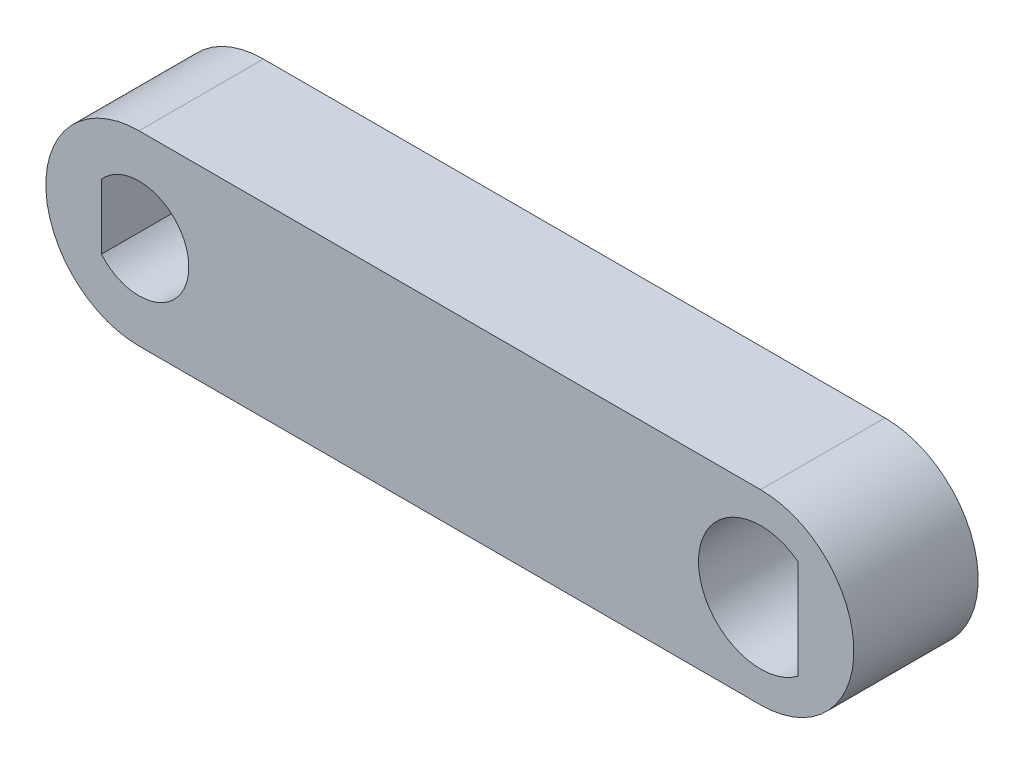
ISO-10303-21;
HEADER;
FILE_DESCRIPTION(('STEP AP214'),'2;1');
FILE_NAME('part.step','',(''),(''),'','','');
FILE_SCHEMA(('AUTOMOTIVE_DESIGN { 1 0 10303 214 1 1 1 1 }'));
ENDSEC;
DATA;
#1=APPLICATION_CONTEXT('core data for automotive mechanical design processes');
#2=APPLICATION_PROTOCOL_DEFINITION('international standard','automotive_design',2000,#1);
#3=PRODUCT_CONTEXT('',#1,'mechanical');
#4=PRODUCT('Part','Part','',(#3));
#5=PRODUCT_RELATED_PRODUCT_CATEGORY('part','',(#4));
#6=PRODUCT_DEFINITION_FORMATION('','',#4);
#7=PRODUCT_DEFINITION_CONTEXT('part definition',#1,'design');
#8=PRODUCT_DEFINITION('design','',#6,#7);
#9=PRODUCT_DEFINITION_SHAPE('','',#8);
#10=(LENGTH_UNIT() NAMED_UNIT(*) SI_UNIT(.MILLI.,.METRE.));
#11=(NAMED_UNIT(*) PLANE_ANGLE_UNIT() SI_UNIT($,.RADIAN.));
#12=(NAMED_UNIT(*) SI_UNIT($,.STERADIAN.) SOLID_ANGLE_UNIT());
#13=UNCERTAINTY_MEASURE_WITH_UNIT(LENGTH_MEASURE(1.E-05),#10,'distance_accuracy_value','');
#14=(GEOMETRIC_REPRESENTATION_CONTEXT(3) GLOBAL_UNCERTAINTY_ASSIGNED_CONTEXT((#13)) GLOBAL_UNIT_ASSIGNED_CONTEXT((#10,
#11,#12)) REPRESENTATION_CONTEXT('',''));
#15=CARTESIAN_POINT('',(0.,0.,0.));
#16=DIRECTION('',(0.,0.,1.));
#17=DIRECTION('',(1.,0.,0.));
#18=AXIS2_PLACEMENT_3D('',#15,#16,#17);
#19=CARTESIAN_POINT('',(0.,0.,10.));
#20=DIRECTION('',(0.,0.,1.));
#21=DIRECTION('',(1.,0.,0.));
#22=AXIS2_PLACEMENT_3D('',#19,#20,#21);
#23=PLANE('',#22);
#24=CARTESIAN_POINT('',(0.,0.,10.));
#25=DIRECTION('',(0.,0.,1.));
#26=DIRECTION('',(1.,0.,0.));
#27=AXIS2_PLACEMENT_3D('',#24,#25,#26);
#28=CIRCLE('',#27,7.5);
#29=CARTESIAN_POINT('',(0.,7.5,10.));
#30=VERTEX_POINT('',#29);
#31=CARTESIAN_POINT('',(0.,-7.5,10.));
#32=VERTEX_POINT('',#31);
#33=EDGE_CURVE('E130',#30,#32,#28,.T.);
#34=ORIENTED_EDGE('',*,*,#33,.T.);
#35=DIRECTION('',(1.,0.,0.));
#36=VECTOR('',#35,1.);
#37=CARTESIAN_POINT('',(0.,-7.5,10.));
#38=LINE('',#37,#36);
#39=CARTESIAN_POINT('',(50.,-7.5,10.));
#40=VERTEX_POINT('',#39);
#41=EDGE_CURVE('E133',#32,#40,#38,.T.);
#42=ORIENTED_EDGE('',*,*,#41,.T.);
#43=CARTESIAN_POINT('',(50.,0.,10.));
#44=DIRECTION('',(0.,0.,1.));
#45=DIRECTION('',(1.,0.,0.));
#46=AXIS2_PLACEMENT_3D('',#43,#44,#45);
#47=CIRCLE('',#46,7.5);
#48=CARTESIAN_POINT('',(50.,7.5,10.));
#49=VERTEX_POINT('',#48);
#50=EDGE_CURVE('E136',#40,#49,#47,.T.);
#51=ORIENTED_EDGE('',*,*,#50,.T.);
#52=DIRECTION('',(-1.,0.,0.));
#53=VECTOR('',#52,1.);
#54=CARTESIAN_POINT('',(0.,7.5,10.));
#55=LINE('',#54,#53);
#56=EDGE_CURVE('E138',#49,#30,#55,.T.);
#57=ORIENTED_EDGE('',*,*,#56,.T.);
#58=EDGE_LOOP('',(#34,#42,#51,#57));
#59=FACE_BOUND('',#58,.T.);
#60=DIRECTION('',(0.,1.,0.));
#61=VECTOR('',#60,1.);
#62=CARTESIAN_POINT('',(53.,4.,10.));
#63=LINE('',#62,#61);
#64=CARTESIAN_POINT('',(53.,-4.,10.));
#65=VERTEX_POINT('',#64);
#66=CARTESIAN_POINT('',(53.,4.,10.));
#67=VERTEX_POINT('',#66);
#68=EDGE_CURVE('E116',#65,#67,#63,.T.);
#69=ORIENTED_EDGE('',*,*,#68,.F.);
#70=CARTESIAN_POINT('',(50.,0.,10.));
#71=DIRECTION('',(0.,0.,1.));
#72=DIRECTION('',(1.,0.,0.));
#73=AXIS2_PLACEMENT_3D('',#70,#71,#72);
#74=CIRCLE('',#73,5.);
#75=EDGE_CURVE('E113',#67,#65,#74,.T.);
#76=ORIENTED_EDGE('',*,*,#75,.F.);
#77=EDGE_LOOP('',(#69,#76));
#78=FACE_BOUND('',#77,.T.);
#79=DIRECTION('',(0.,-1.,0.));
#80=VECTOR('',#79,1.);
#81=CARTESIAN_POINT('',(-3.02977091663549,2.61160643909256,10.));
#82=LINE('',#81,#80);
#83=CARTESIAN_POINT('',(-3.02977091663549,2.61160643909256,10.));
#84=VERTEX_POINT('',#83);
#85=CARTESIAN_POINT('',(-3.02977091663549,-2.61160643909256,10.));
#86=VERTEX_POINT('',#85);
#87=EDGE_CURVE('E96',#84,#86,#82,.T.);
#88=ORIENTED_EDGE('',*,*,#87,.F.);
#89=CARTESIAN_POINT('',(0.,0.,10.));
#90=DIRECTION('',(0.,0.,1.));
#91=DIRECTION('',(1.,0.,0.));
#92=AXIS2_PLACEMENT_3D('',#89,#90,#91);
#93=CIRCLE('',#92,4.);
#94=EDGE_CURVE('E102',#86,#84,#93,.T.);
#95=ORIENTED_EDGE('',*,*,#94,.F.);
#96=EDGE_LOOP('',(#88,#95));
#97=FACE_BOUND('',#96,.T.);
#98=ADVANCED_FACE('F32',(#59,#78,#97),#23,.T.);
#99=CARTESIAN_POINT('',(0.,0.,0.));
#100=DIRECTION('',(0.,0.,1.));
#101=DIRECTION('',(1.,0.,0.));
#102=AXIS2_PLACEMENT_3D('',#99,#100,#101);
#103=PLANE('',#102);
#104=CARTESIAN_POINT('',(50.,0.,0.));
#105=DIRECTION('',(0.,0.,1.));
#106=DIRECTION('',(1.,0.,0.));
#107=AXIS2_PLACEMENT_3D('',#104,#105,#106);
#108=CIRCLE('',#107,5.);
#109=CARTESIAN_POINT('',(53.,4.,0.));
#110=VERTEX_POINT('',#109);
#111=CARTESIAN_POINT('',(53.,-4.,0.));
#112=VERTEX_POINT('',#111);
#113=EDGE_CURVE('E112',#110,#112,#108,.T.);
#114=ORIENTED_EDGE('',*,*,#113,.T.);
#115=DIRECTION('',(0.,1.,0.));
#116=VECTOR('',#115,1.);
#117=CARTESIAN_POINT('',(53.,4.,0.));
#118=LINE('',#117,#116);
#119=EDGE_CURVE('E117',#112,#110,#118,.T.);
#120=ORIENTED_EDGE('',*,*,#119,.T.);
#121=EDGE_LOOP('',(#114,#120));
#122=FACE_BOUND('',#121,.T.);
#123=CARTESIAN_POINT('',(0.,0.,0.));
#124=DIRECTION('',(0.,0.,1.));
#125=DIRECTION('',(1.,0.,0.));
#126=AXIS2_PLACEMENT_3D('',#123,#124,#125);
#127=CIRCLE('',#126,7.5);
#128=CARTESIAN_POINT('',(0.,7.5,0.));
#129=VERTEX_POINT('',#128);
#130=CARTESIAN_POINT('',(0.,-7.5,0.));
#131=VERTEX_POINT('',#130);
#132=EDGE_CURVE('E129',#129,#131,#127,.T.);
#133=ORIENTED_EDGE('',*,*,#132,.F.);
#134=DIRECTION('',(-1.,0.,0.));
#135=VECTOR('',#134,1.);
#136=CARTESIAN_POINT('',(0.,7.5,0.));
#137=LINE('',#136,#135);
#138=CARTESIAN_POINT('',(50.,7.5,0.));
#139=VERTEX_POINT('',#138);
#140=EDGE_CURVE('E134',#139,#129,#137,.T.);
#141=ORIENTED_EDGE('',*,*,#140,.F.);
#142=CARTESIAN_POINT('',(50.,0.,0.));
#143=DIRECTION('',(0.,0.,1.));
#144=DIRECTION('',(1.,0.,0.));
#145=AXIS2_PLACEMENT_3D('',#142,#143,#144);
#146=CIRCLE('',#145,7.5);
#147=CARTESIAN_POINT('',(50.,-7.5,0.));
#148=VERTEX_POINT('',#147);
#149=EDGE_CURVE('E145',#148,#139,#146,.T.);
#150=ORIENTED_EDGE('',*,*,#149,.F.);
#151=DIRECTION('',(1.,0.,0.));
#152=VECTOR('',#151,1.);
#153=CARTESIAN_POINT('',(0.,-7.5,0.));
#154=LINE('',#153,#152);
#155=EDGE_CURVE('E143',#131,#148,#154,.T.);
#156=ORIENTED_EDGE('',*,*,#155,.F.);
#157=EDGE_LOOP('',(#133,#141,#150,#156));
#158=FACE_BOUND('',#157,.T.);
#159=CARTESIAN_POINT('',(0.,0.,0.));
#160=DIRECTION('',(0.,0.,1.));
#161=DIRECTION('',(1.,0.,0.));
#162=AXIS2_PLACEMENT_3D('',#159,#160,#161);
#163=CIRCLE('',#162,4.);
#164=CARTESIAN_POINT('',(-3.02977091663549,-2.61160643909256,0.));
#165=VERTEX_POINT('',#164);
#166=CARTESIAN_POINT('',(-3.02977091663549,2.61160643909256,0.));
#167=VERTEX_POINT('',#166);
#168=EDGE_CURVE('E54',#165,#167,#163,.T.);
#169=ORIENTED_EDGE('',*,*,#168,.T.);
#170=DIRECTION('',(0.,-1.,0.));
#171=VECTOR('',#170,1.);
#172=CARTESIAN_POINT('',(-3.02977091663549,2.61160643909256,0.));
#173=LINE('',#172,#171);
#174=EDGE_CURVE('E106',#167,#165,#173,.T.);
#175=ORIENTED_EDGE('',*,*,#174,.T.);
#176=EDGE_LOOP('',(#169,#175));
#177=FACE_BOUND('',#176,.T.);
#178=ADVANCED_FACE('F163',(#122,#158,#177),#103,.F.);
#179=CARTESIAN_POINT('',(0.,0.,10.));
#180=DIRECTION('',(0.,0.,-1.));
#181=DIRECTION('',(-1.,0.,0.));
#182=AXIS2_PLACEMENT_3D('',#179,#180,#181);
#183=CYLINDRICAL_SURFACE('',#182,7.5);
#184=ORIENTED_EDGE('',*,*,#132,.T.);
#185=DIRECTION('',(0.,0.,-1.));
#186=VECTOR('',#185,1.);
#187=CARTESIAN_POINT('',(0.,-7.5,10.));
#188=LINE('',#187,#186);
#189=EDGE_CURVE('E11',#32,#131,#188,.T.);
#190=ORIENTED_EDGE('',*,*,#189,.F.);
#191=ORIENTED_EDGE('',*,*,#33,.F.);
#192=DIRECTION('',(0.,0.,-1.));
#193=VECTOR('',#192,1.);
#194=CARTESIAN_POINT('',(0.,7.5,10.));
#195=LINE('',#194,#193);
#196=EDGE_CURVE('E140',#30,#129,#195,.T.);
#197=ORIENTED_EDGE('',*,*,#196,.T.);
#198=EDGE_LOOP('',(#184,#190,#191,#197));
#199=FACE_BOUND('',#198,.T.);
#200=ADVANCED_FACE('F34',(#199),#183,.T.);
#201=CARTESIAN_POINT('',(0.,-7.5,10.));
#202=DIRECTION('',(0.,1.,0.));
#203=DIRECTION('',(0.,0.,1.));
#204=AXIS2_PLACEMENT_3D('',#201,#202,#203);
#205=PLANE('',#204);
#206=ORIENTED_EDGE('',*,*,#155,.T.);
#207=DIRECTION('',(0.,0.,-1.));
#208=VECTOR('',#207,1.);
#209=CARTESIAN_POINT('',(50.,-7.5,10.));
#210=LINE('',#209,#208);
#211=EDGE_CURVE('E40',#40,#148,#210,.T.);
#212=ORIENTED_EDGE('',*,*,#211,.F.);
#213=ORIENTED_EDGE('',*,*,#41,.F.);
#214=ORIENTED_EDGE('',*,*,#189,.T.);
#215=EDGE_LOOP('',(#206,#212,#213,#214));
#216=FACE_BOUND('',#215,.T.);
#217=ADVANCED_FACE('F174',(#216),#205,.F.);
#218=CARTESIAN_POINT('',(50.,0.,10.));
#219=DIRECTION('',(0.,0.,-1.));
#220=DIRECTION('',(-1.,0.,0.));
#221=AXIS2_PLACEMENT_3D('',#218,#219,#220);
#222=CYLINDRICAL_SURFACE('',#221,7.5);
#223=ORIENTED_EDGE('',*,*,#149,.T.);
#224=DIRECTION('',(0.,0.,-1.));
#225=VECTOR('',#224,1.);
#226=CARTESIAN_POINT('',(50.,7.5,10.));
#227=LINE('',#226,#225);
#228=EDGE_CURVE('E150',#49,#139,#227,.T.);
#229=ORIENTED_EDGE('',*,*,#228,.F.);
#230=ORIENTED_EDGE('',*,*,#50,.F.);
#231=ORIENTED_EDGE('',*,*,#211,.T.);
#232=EDGE_LOOP('',(#223,#229,#230,#231));
#233=FACE_BOUND('',#232,.T.);
#234=ADVANCED_FACE('F157',(#233),#222,.T.);
#235=CARTESIAN_POINT('',(0.,7.5,10.));
#236=DIRECTION('',(0.,-1.,0.));
#237=DIRECTION('',(0.,0.,-1.));
#238=AXIS2_PLACEMENT_3D('',#235,#236,#237);
#239=PLANE('',#238);
#240=ORIENTED_EDGE('',*,*,#140,.T.);
#241=ORIENTED_EDGE('',*,*,#196,.F.);
#242=ORIENTED_EDGE('',*,*,#56,.F.);
#243=ORIENTED_EDGE('',*,*,#228,.T.);
#244=EDGE_LOOP('',(#240,#241,#242,#243));
#245=FACE_BOUND('',#244,.T.);
#246=ADVANCED_FACE('F167',(#245),#239,.F.);
#247=CARTESIAN_POINT('',(50.,0.,10.));
#248=DIRECTION('',(0.,0.,-1.));
#249=DIRECTION('',(-1.,0.,0.));
#250=AXIS2_PLACEMENT_3D('',#247,#248,#249);
#251=CYLINDRICAL_SURFACE('',#250,5.);
#252=ORIENTED_EDGE('',*,*,#113,.F.);
#253=DIRECTION('',(0.,0.,-1.));
#254=VECTOR('',#253,1.);
#255=CARTESIAN_POINT('',(53.,4.,10.));
#256=LINE('',#255,#254);
#257=EDGE_CURVE('E119',#67,#110,#256,.T.);
#258=ORIENTED_EDGE('',*,*,#257,.F.);
#259=ORIENTED_EDGE('',*,*,#75,.T.);
#260=DIRECTION('',(0.,0.,-1.));
#261=VECTOR('',#260,1.);
#262=CARTESIAN_POINT('',(53.,-4.,10.));
#263=LINE('',#262,#261);
#264=EDGE_CURVE('E126',#65,#112,#263,.T.);
#265=ORIENTED_EDGE('',*,*,#264,.T.);
#266=EDGE_LOOP('',(#252,#258,#259,#265));
#267=FACE_BOUND('',#266,.T.);
#268=ADVANCED_FACE('F189',(#267),#251,.F.);
#269=CARTESIAN_POINT('',(53.,4.,10.));
#270=DIRECTION('',(-1.,0.,0.));
#271=DIRECTION('',(0.,0.,1.));
#272=AXIS2_PLACEMENT_3D('',#269,#270,#271);
#273=PLANE('',#272);
#274=ORIENTED_EDGE('',*,*,#119,.F.);
#275=ORIENTED_EDGE('',*,*,#264,.F.);
#276=ORIENTED_EDGE('',*,*,#68,.T.);
#277=ORIENTED_EDGE('',*,*,#257,.T.);
#278=EDGE_LOOP('',(#274,#275,#276,#277));
#279=FACE_BOUND('',#278,.T.);
#280=ADVANCED_FACE('F196',(#279),#273,.T.);
#281=CARTESIAN_POINT('',(0.,0.,10.));
#282=DIRECTION('',(0.,0.,-1.));
#283=DIRECTION('',(-1.,0.,0.));
#284=AXIS2_PLACEMENT_3D('',#281,#282,#283);
#285=CYLINDRICAL_SURFACE('',#284,4.);
#286=ORIENTED_EDGE('',*,*,#168,.F.);
#287=DIRECTION('',(0.,0.,-1.));
#288=VECTOR('',#287,1.);
#289=CARTESIAN_POINT('',(-3.02977091663549,-2.61160643909256,10.));
#290=LINE('',#289,#288);
#291=EDGE_CURVE('E98',#86,#165,#290,.T.);
#292=ORIENTED_EDGE('',*,*,#291,.F.);
#293=ORIENTED_EDGE('',*,*,#94,.T.);
#294=DIRECTION('',(0.,0.,-1.));
#295=VECTOR('',#294,1.);
#296=CARTESIAN_POINT('',(-3.02977091663549,2.61160643909256,10.));
#297=LINE('',#296,#295);
#298=EDGE_CURVE('E47',#84,#167,#297,.T.);
#299=ORIENTED_EDGE('',*,*,#298,.T.);
#300=EDGE_LOOP('',(#286,#292,#293,#299));
#301=FACE_BOUND('',#300,.T.);
#302=ADVANCED_FACE('F104',(#301),#285,.F.);
#303=CARTESIAN_POINT('',(-3.02977091663549,2.61160643909256,10.));
#304=DIRECTION('',(1.,0.,0.));
#305=DIRECTION('',(0.,0.,-1.));
#306=AXIS2_PLACEMENT_3D('',#303,#304,#305);
#307=PLANE('',#306);
#308=ORIENTED_EDGE('',*,*,#174,.F.);
#309=ORIENTED_EDGE('',*,*,#298,.F.);
#310=ORIENTED_EDGE('',*,*,#87,.T.);
#311=ORIENTED_EDGE('',*,*,#291,.T.);
#312=EDGE_LOOP('',(#308,#309,#310,#311));
#313=FACE_BOUND('',#312,.T.);
#314=ADVANCED_FACE('F97',(#313),#307,.T.);
#315=CLOSED_SHELL('',(#98,#178,#200,#217,#234,#246,#268,#280,#302,#314));
#316=MANIFOLD_SOLID_BREP('B2',#315);
#317=ADVANCED_BREP_SHAPE_REPRESENTATION('',(#18,#316),#14);
#318=SHAPE_DEFINITION_REPRESENTATION(#9,#317);
ENDSEC;
END-ISO-10303-21;
